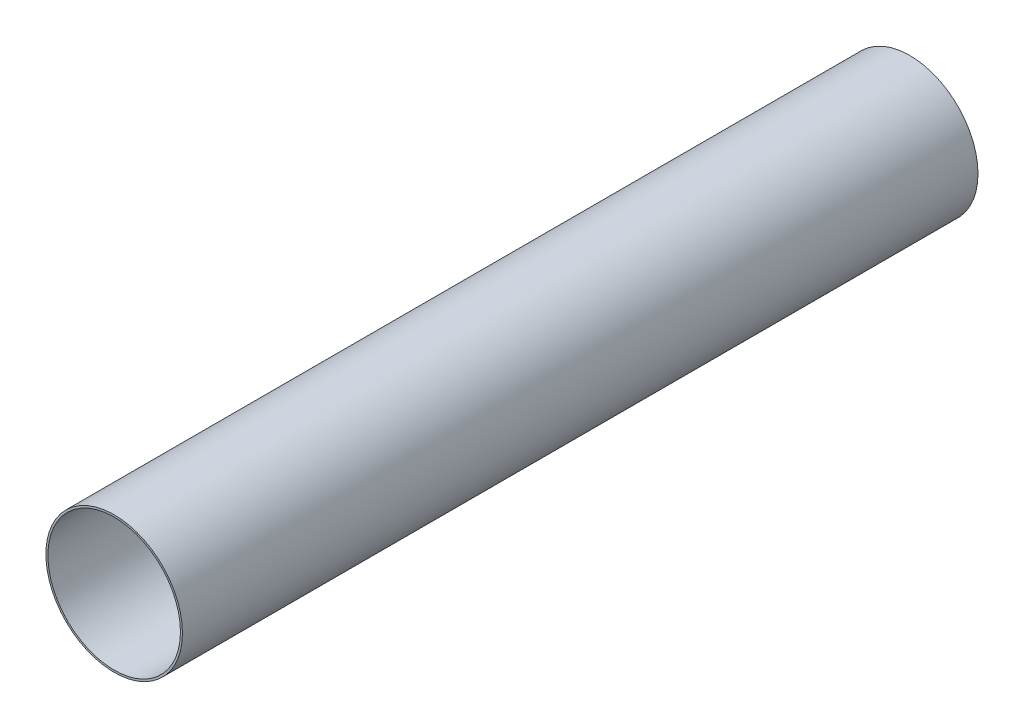
ISO-10303-21;
HEADER;
FILE_DESCRIPTION(('STEP AP214'),'2;1');
FILE_NAME('part.step','',(''),(''),'','','');
FILE_SCHEMA(('AUTOMOTIVE_DESIGN { 1 0 10303 214 1 1 1 1 }'));
ENDSEC;
DATA;
#1=APPLICATION_CONTEXT('core data for automotive mechanical design processes');
#2=APPLICATION_PROTOCOL_DEFINITION('international standard','automotive_design',2000,#1);
#3=PRODUCT_CONTEXT('',#1,'mechanical');
#4=PRODUCT('Part','Part','',(#3));
#5=PRODUCT_RELATED_PRODUCT_CATEGORY('part','',(#4));
#6=PRODUCT_DEFINITION_FORMATION('','',#4);
#7=PRODUCT_DEFINITION_CONTEXT('part definition',#1,'design');
#8=PRODUCT_DEFINITION('design','',#6,#7);
#9=PRODUCT_DEFINITION_SHAPE('','',#8);
#10=(LENGTH_UNIT() NAMED_UNIT(*) SI_UNIT(.MILLI.,.METRE.));
#11=(NAMED_UNIT(*) PLANE_ANGLE_UNIT() SI_UNIT($,.RADIAN.));
#12=(NAMED_UNIT(*) SI_UNIT($,.STERADIAN.) SOLID_ANGLE_UNIT());
#13=UNCERTAINTY_MEASURE_WITH_UNIT(LENGTH_MEASURE(1.E-05),#10,'distance_accuracy_value','');
#14=(GEOMETRIC_REPRESENTATION_CONTEXT(3) GLOBAL_UNCERTAINTY_ASSIGNED_CONTEXT((#13)) GLOBAL_UNIT_ASSIGNED_CONTEXT((#10,
#11,#12)) REPRESENTATION_CONTEXT('',''));
#15=CARTESIAN_POINT('',(0.,0.,0.));
#16=DIRECTION('',(0.,0.,1.));
#17=DIRECTION('',(1.,0.,0.));
#18=AXIS2_PLACEMENT_3D('',#15,#16,#17);
#19=CARTESIAN_POINT('',(0.,0.,381.));
#20=DIRECTION('',(0.,0.,1.));
#21=DIRECTION('',(1.,0.,0.));
#22=AXIS2_PLACEMENT_3D('',#19,#20,#21);
#23=PLANE('',#22);
#24=CARTESIAN_POINT('',(0.,0.,381.));
#25=DIRECTION('',(0.,0.,1.));
#26=DIRECTION('',(1.,0.,0.));
#27=AXIS2_PLACEMENT_3D('',#24,#25,#26);
#28=CIRCLE('',#27,65.405);
#29=CARTESIAN_POINT('',(65.405,0.,381.));
#30=VERTEX_POINT('',#29);
#31=EDGE_CURVE('E10',#30,#30,#28,.T.);
#32=ORIENTED_EDGE('',*,*,#31,.T.);
#33=EDGE_LOOP('',(#32));
#34=FACE_BOUND('',#33,.T.);
#35=CARTESIAN_POINT('',(0.,0.,381.));
#36=DIRECTION('',(0.,0.,1.));
#37=DIRECTION('',(1.,0.,0.));
#38=AXIS2_PLACEMENT_3D('',#35,#36,#37);
#39=CIRCLE('',#38,63.5);
#40=CARTESIAN_POINT('',(63.5,0.,381.));
#41=VERTEX_POINT('',#40);
#42=EDGE_CURVE('E54',#41,#41,#39,.T.);
#43=ORIENTED_EDGE('',*,*,#42,.F.);
#44=EDGE_LOOP('',(#43));
#45=FACE_BOUND('',#44,.T.);
#46=ADVANCED_FACE('F43',(#34,#45),#23,.T.);
#47=CARTESIAN_POINT('',(0.,0.,-381.));
#48=DIRECTION('',(0.,0.,1.));
#49=DIRECTION('',(1.,0.,0.));
#50=AXIS2_PLACEMENT_3D('',#47,#48,#49);
#51=PLANE('',#50);
#52=CARTESIAN_POINT('',(0.,0.,-381.));
#53=DIRECTION('',(0.,0.,1.));
#54=DIRECTION('',(1.,0.,0.));
#55=AXIS2_PLACEMENT_3D('',#52,#53,#54);
#56=CIRCLE('',#55,65.405);
#57=CARTESIAN_POINT('',(65.405,0.,-381.));
#58=VERTEX_POINT('',#57);
#59=EDGE_CURVE('E47',#58,#58,#56,.T.);
#60=ORIENTED_EDGE('',*,*,#59,.F.);
#61=EDGE_LOOP('',(#60));
#62=FACE_BOUND('',#61,.T.);
#63=CARTESIAN_POINT('',(0.,0.,-381.));
#64=DIRECTION('',(0.,0.,1.));
#65=DIRECTION('',(1.,0.,0.));
#66=AXIS2_PLACEMENT_3D('',#63,#64,#65);
#67=CIRCLE('',#66,63.5);
#68=CARTESIAN_POINT('',(63.5,0.,-381.));
#69=VERTEX_POINT('',#68);
#70=EDGE_CURVE('E56',#69,#69,#67,.T.);
#71=ORIENTED_EDGE('',*,*,#70,.T.);
#72=EDGE_LOOP('',(#71));
#73=FACE_BOUND('',#72,.T.);
#74=ADVANCED_FACE('F66',(#62,#73),#51,.F.);
#75=CARTESIAN_POINT('',(0.,0.,381.));
#76=DIRECTION('',(0.,0.,-1.));
#77=DIRECTION('',(-1.,0.,0.));
#78=AXIS2_PLACEMENT_3D('',#75,#76,#77);
#79=CYLINDRICAL_SURFACE('',#78,65.405);
#80=ORIENTED_EDGE('',*,*,#31,.F.);
#81=EDGE_LOOP('',(#80));
#82=FACE_BOUND('',#81,.T.);
#83=ORIENTED_EDGE('',*,*,#59,.T.);
#84=EDGE_LOOP('',(#83));
#85=FACE_BOUND('',#84,.T.);
#86=ADVANCED_FACE('F45',(#82,#85),#79,.T.);
#87=CARTESIAN_POINT('',(0.,0.,381.));
#88=DIRECTION('',(0.,0.,-1.));
#89=DIRECTION('',(-1.,0.,0.));
#90=AXIS2_PLACEMENT_3D('',#87,#88,#89);
#91=CYLINDRICAL_SURFACE('',#90,63.5);
#92=ORIENTED_EDGE('',*,*,#42,.T.);
#93=EDGE_LOOP('',(#92));
#94=FACE_BOUND('',#93,.T.);
#95=ORIENTED_EDGE('',*,*,#70,.F.);
#96=EDGE_LOOP('',(#95));
#97=FACE_BOUND('',#96,.T.);
#98=ADVANCED_FACE('F62',(#94,#97),#91,.F.);
#99=CLOSED_SHELL('',(#46,#74,#86,#98));
#100=MANIFOLD_SOLID_BREP('B2',#99);
#101=ADVANCED_BREP_SHAPE_REPRESENTATION('',(#18,#100),#14);
#102=SHAPE_DEFINITION_REPRESENTATION(#9,#101);
ENDSEC;
END-ISO-10303-21;
